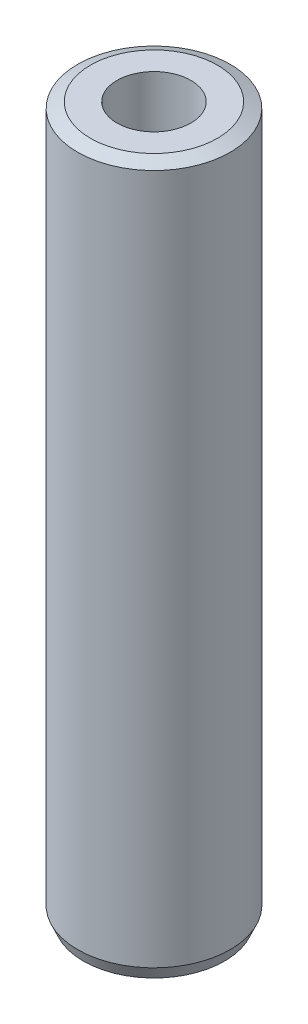
ISO-10303-21;
HEADER;
FILE_DESCRIPTION(('STEP AP214'),'2;1');
FILE_NAME('part.step','',(''),(''),'','','');
FILE_SCHEMA(('AUTOMOTIVE_DESIGN { 1 0 10303 214 1 1 1 1 }'));
ENDSEC;
DATA;
#1=APPLICATION_CONTEXT('core data for automotive mechanical design processes');
#2=APPLICATION_PROTOCOL_DEFINITION('international standard','automotive_design',2000,#1);
#3=PRODUCT_CONTEXT('',#1,'mechanical');
#4=PRODUCT('Part','Part','',(#3));
#5=PRODUCT_RELATED_PRODUCT_CATEGORY('part','',(#4));
#6=PRODUCT_DEFINITION_FORMATION('','',#4);
#7=PRODUCT_DEFINITION_CONTEXT('part definition',#1,'design');
#8=PRODUCT_DEFINITION('design','',#6,#7);
#9=PRODUCT_DEFINITION_SHAPE('','',#8);
#10=(LENGTH_UNIT() NAMED_UNIT(*) SI_UNIT(.MILLI.,.METRE.));
#11=(NAMED_UNIT(*) PLANE_ANGLE_UNIT() SI_UNIT($,.RADIAN.));
#12=(NAMED_UNIT(*) SI_UNIT($,.STERADIAN.) SOLID_ANGLE_UNIT());
#13=UNCERTAINTY_MEASURE_WITH_UNIT(LENGTH_MEASURE(1.E-05),#10,'distance_accuracy_value','');
#14=(GEOMETRIC_REPRESENTATION_CONTEXT(3) GLOBAL_UNCERTAINTY_ASSIGNED_CONTEXT((#13)) GLOBAL_UNIT_ASSIGNED_CONTEXT((#10,
#11,#12)) REPRESENTATION_CONTEXT('',''));
#15=CARTESIAN_POINT('',(0.,0.,0.));
#16=DIRECTION('',(0.,0.,1.));
#17=DIRECTION('',(1.,0.,0.));
#18=AXIS2_PLACEMENT_3D('',#15,#16,#17);
#19=CARTESIAN_POINT('',(0.,69.7103753887497,0.));
#20=DIRECTION('',(0.,-1.,0.));
#21=DIRECTION('',(0.,0.,-1.));
#22=AXIS2_PLACEMENT_3D('',#19,#20,#21);
#23=CYLINDRICAL_SURFACE('',#22,7.5);
#24=CARTESIAN_POINT('',(0.,69.1519414290113,0.));
#25=DIRECTION('',(0.,1.,0.));
#26=DIRECTION('',(0.,0.,1.));
#27=AXIS2_PLACEMENT_3D('',#24,#25,#26);
#28=CIRCLE('',#27,7.5);
#29=CARTESIAN_POINT('',(0.,69.1519414290113,7.5));
#30=VERTEX_POINT('',#29);
#31=EDGE_CURVE('E50',#30,#30,#28,.F.);
#32=ORIENTED_EDGE('',*,*,#31,.T.);
#33=EDGE_LOOP('',(#32));
#34=FACE_BOUND('',#33,.T.);
#35=CARTESIAN_POINT('',(0.,1.26098979903484,0.));
#36=DIRECTION('',(0.,1.,0.));
#37=DIRECTION('',(0.,0.,1.));
#38=AXIS2_PLACEMENT_3D('',#35,#36,#37);
#39=CIRCLE('',#38,7.5);
#40=CARTESIAN_POINT('',(0.,1.26098979903484,7.5));
#41=VERTEX_POINT('',#40);
#42=EDGE_CURVE('E51',#41,#41,#39,.T.);
#43=ORIENTED_EDGE('',*,*,#42,.T.);
#44=EDGE_LOOP('',(#43));
#45=FACE_BOUND('',#44,.T.);
#46=ADVANCED_FACE('F39',(#34,#45),#23,.T.);
#47=CARTESIAN_POINT('',(0.,69.7103753887497,0.));
#48=DIRECTION('',(0.,1.,0.));
#49=DIRECTION('',(0.,0.,1.));
#50=AXIS2_PLACEMENT_3D('',#47,#48,#49);
#51=PLANE('',#50);
#52=CARTESIAN_POINT('',(0.,69.7103753887497,0.));
#53=DIRECTION('',(0.,1.,0.));
#54=DIRECTION('',(0.,0.,1.));
#55=AXIS2_PLACEMENT_3D('',#52,#53,#54);
#56=CIRCLE('',#55,6.23901020096519);
#57=CARTESIAN_POINT('',(0.,69.7103753887497,6.23901020096519));
#58=VERTEX_POINT('',#57);
#59=EDGE_CURVE('E54',#58,#58,#56,.T.);
#60=ORIENTED_EDGE('',*,*,#59,.T.);
#61=EDGE_LOOP('',(#60));
#62=FACE_BOUND('',#61,.T.);
#63=CARTESIAN_POINT('',(0.,69.7103753887497,0.));
#64=DIRECTION('',(0.,1.,0.));
#65=DIRECTION('',(0.,0.,1.));
#66=AXIS2_PLACEMENT_3D('',#63,#64,#65);
#67=CIRCLE('',#66,3.63491563114357);
#68=CARTESIAN_POINT('',(0.,69.7103753887497,3.63491563114357));
#69=VERTEX_POINT('',#68);
#70=EDGE_CURVE('E58',#69,#69,#67,.T.);
#71=ORIENTED_EDGE('',*,*,#70,.F.);
#72=EDGE_LOOP('',(#71));
#73=FACE_BOUND('',#72,.T.);
#74=ADVANCED_FACE('F69',(#62,#73),#51,.T.);
#75=CARTESIAN_POINT('',(0.,0.,0.));
#76=DIRECTION('',(0.,1.,0.));
#77=DIRECTION('',(0.,0.,1.));
#78=AXIS2_PLACEMENT_3D('',#75,#76,#77);
#79=PLANE('',#78);
#80=CARTESIAN_POINT('',(0.,0.,0.));
#81=DIRECTION('',(0.,1.,0.));
#82=DIRECTION('',(0.,0.,1.));
#83=AXIS2_PLACEMENT_3D('',#80,#81,#82);
#84=CIRCLE('',#83,6.94156604026164);
#85=CARTESIAN_POINT('',(0.,0.,6.94156604026164));
#86=VERTEX_POINT('',#85);
#87=EDGE_CURVE('E10',#86,#86,#84,.F.);
#88=ORIENTED_EDGE('',*,*,#87,.T.);
#89=EDGE_LOOP('',(#88));
#90=FACE_BOUND('',#89,.T.);
#91=CARTESIAN_POINT('',(0.,0.,0.));
#92=DIRECTION('',(0.,1.,0.));
#93=DIRECTION('',(0.,0.,1.));
#94=AXIS2_PLACEMENT_3D('',#91,#92,#93);
#95=CIRCLE('',#94,3.63491563114357);
#96=CARTESIAN_POINT('',(0.,0.,3.63491563114357));
#97=VERTEX_POINT('',#96);
#98=EDGE_CURVE('E63',#97,#97,#95,.T.);
#99=ORIENTED_EDGE('',*,*,#98,.T.);
#100=EDGE_LOOP('',(#99));
#101=FACE_BOUND('',#100,.T.);
#102=ADVANCED_FACE('F75',(#90,#101),#79,.F.);
#103=CARTESIAN_POINT('',(0.,69.7103753887497,0.));
#104=DIRECTION('',(0.,-1.,0.));
#105=DIRECTION('',(0.,0.,-1.));
#106=AXIS2_PLACEMENT_3D('',#103,#104,#105);
#107=CYLINDRICAL_SURFACE('',#106,3.63491563114357);
#108=ORIENTED_EDGE('',*,*,#70,.T.);
#109=EDGE_LOOP('',(#108));
#110=FACE_BOUND('',#109,.T.);
#111=ORIENTED_EDGE('',*,*,#98,.F.);
#112=EDGE_LOOP('',(#111));
#113=FACE_BOUND('',#112,.T.);
#114=ADVANCED_FACE('F70',(#110,#113),#107,.F.);
#115=CARTESIAN_POINT('',(0.,69.7103753887497,0.));
#116=DIRECTION('',(0.,-1.,0.));
#117=DIRECTION('',(0.,0.,-1.));
#118=AXIS2_PLACEMENT_3D('',#115,#116,#117);
#119=CONICAL_SURFACE('',#118,6.23901020096519,1.15390116021385);
#120=ORIENTED_EDGE('',*,*,#31,.F.);
#121=EDGE_LOOP('',(#120));
#122=FACE_BOUND('',#121,.T.);
#123=ORIENTED_EDGE('',*,*,#59,.F.);
#124=EDGE_LOOP('',(#123));
#125=FACE_BOUND('',#124,.T.);
#126=ADVANCED_FACE('F81',(#122,#125),#119,.T.);
#127=CARTESIAN_POINT('',(0.,1.26098979903484,0.));
#128=DIRECTION('',(0.,1.,0.));
#129=DIRECTION('',(0.,0.,1.));
#130=AXIS2_PLACEMENT_3D('',#127,#128,#129);
#131=CONICAL_SURFACE('',#130,7.5,0.416895166581044);
#132=ORIENTED_EDGE('',*,*,#87,.F.);
#133=EDGE_LOOP('',(#132));
#134=FACE_BOUND('',#133,.T.);
#135=ORIENTED_EDGE('',*,*,#42,.F.);
#136=EDGE_LOOP('',(#135));
#137=FACE_BOUND('',#136,.T.);
#138=ADVANCED_FACE('F45',(#134,#137),#131,.T.);
#139=CLOSED_SHELL('',(#46,#74,#102,#114,#126,#138));
#140=MANIFOLD_SOLID_BREP('B2',#139);
#141=ADVANCED_BREP_SHAPE_REPRESENTATION('',(#18,#140),#14);
#142=SHAPE_DEFINITION_REPRESENTATION(#9,#141);
ENDSEC;
END-ISO-10303-21;
